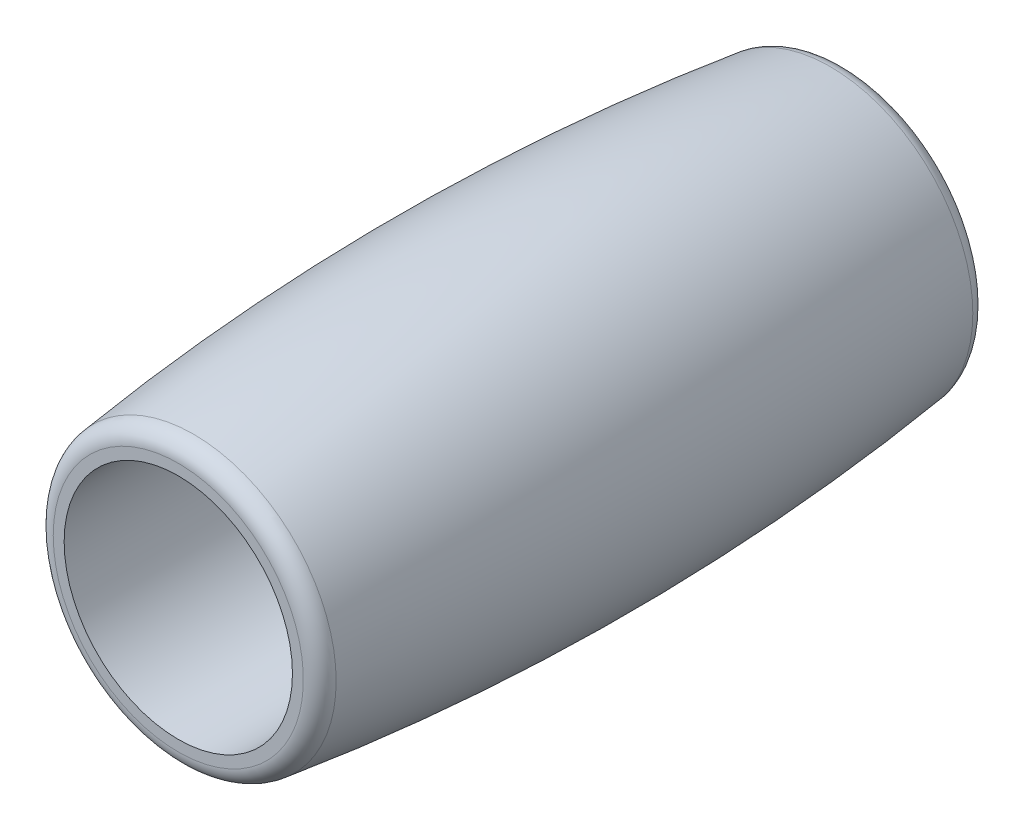
ISO-10303-21;
HEADER;
FILE_DESCRIPTION(('STEP AP214'),'2;1');
FILE_NAME('part.step','',(''),(''),'','','');
FILE_SCHEMA(('AUTOMOTIVE_DESIGN { 1 0 10303 214 1 1 1 1 }'));
ENDSEC;
DATA;
#1=APPLICATION_CONTEXT('core data for automotive mechanical design processes');
#2=APPLICATION_PROTOCOL_DEFINITION('international standard','automotive_design',2000,#1);
#3=PRODUCT_CONTEXT('',#1,'mechanical');
#4=PRODUCT('Part','Part','',(#3));
#5=PRODUCT_RELATED_PRODUCT_CATEGORY('part','',(#4));
#6=PRODUCT_DEFINITION_FORMATION('','',#4);
#7=PRODUCT_DEFINITION_CONTEXT('part definition',#1,'design');
#8=PRODUCT_DEFINITION('design','',#6,#7);
#9=PRODUCT_DEFINITION_SHAPE('','',#8);
#10=(LENGTH_UNIT() NAMED_UNIT(*) SI_UNIT(.MILLI.,.METRE.));
#11=(NAMED_UNIT(*) PLANE_ANGLE_UNIT() SI_UNIT($,.RADIAN.));
#12=(NAMED_UNIT(*) SI_UNIT($,.STERADIAN.) SOLID_ANGLE_UNIT());
#13=UNCERTAINTY_MEASURE_WITH_UNIT(LENGTH_MEASURE(1.E-05),#10,'distance_accuracy_value','');
#14=(GEOMETRIC_REPRESENTATION_CONTEXT(3) GLOBAL_UNCERTAINTY_ASSIGNED_CONTEXT((#13)) GLOBAL_UNIT_ASSIGNED_CONTEXT((#10,
#11,#12)) REPRESENTATION_CONTEXT('',''));
#15=CARTESIAN_POINT('',(0.,0.,0.));
#16=DIRECTION('',(0.,0.,1.));
#17=DIRECTION('',(1.,0.,0.));
#18=AXIS2_PLACEMENT_3D('',#15,#16,#17);
#19=CARTESIAN_POINT('',(0.,0.,-0.597114905425203));
#20=DIRECTION('',(0.,0.,-1.));
#21=DIRECTION('',(-1.,0.,0.));
#22=AXIS2_PLACEMENT_3D('',#19,#20,#21);
#23=DEGENERATE_TOROIDAL_SURFACE('',#22,135.775,145.025,.F.);
#24=CARTESIAN_POINT('',(0.,0.,-18.7220932078033));
#25=DIRECTION('',(0.,0.,1.));
#26=DIRECTION('',(1.,0.,0.));
#27=AXIS2_PLACEMENT_3D('',#24,#25,#26);
#28=CIRCLE('',#27,8.11292786936064);
#29=CARTESIAN_POINT('',(8.11292786936064,0.,-18.7220932078033));
#30=VERTEX_POINT('',#29);
#31=EDGE_CURVE('E10',#30,#30,#28,.T.);
#32=ORIENTED_EDGE('',*,*,#31,.T.);
#33=EDGE_LOOP('',(#32));
#34=FACE_BOUND('',#33,.T.);
#35=CARTESIAN_POINT('',(0.,0.,17.5278633969529));
#36=DIRECTION('',(0.,0.,-1.));
#37=DIRECTION('',(-1.,0.,0.));
#38=AXIS2_PLACEMENT_3D('',#35,#36,#37);
#39=CIRCLE('',#38,8.11292786936064);
#40=CARTESIAN_POINT('',(-8.11292786936064,0.,17.5278633969529));
#41=VERTEX_POINT('',#40);
#42=EDGE_CURVE('E55',#41,#41,#39,.T.);
#43=ORIENTED_EDGE('',*,*,#42,.T.);
#44=EDGE_LOOP('',(#43));
#45=FACE_BOUND('',#44,.T.);
#46=ADVANCED_FACE('F36',(#34,#45),#23,.F.);
#47=CARTESIAN_POINT('',(8.,0.,-19.5971149054252));
#48=DIRECTION('',(0.,0.,1.));
#49=DIRECTION('',(1.,0.,0.));
#50=AXIS2_PLACEMENT_3D('',#47,#48,#49);
#51=PLANE('',#50);
#52=CARTESIAN_POINT('',(0.,0.,-19.5971149054252));
#53=DIRECTION('',(0.,0.,1.));
#54=DIRECTION('',(1.,0.,0.));
#55=AXIS2_PLACEMENT_3D('',#52,#53,#54);
#56=CIRCLE('',#55,7.120768394309);
#57=CARTESIAN_POINT('',(7.120768394309,0.,-19.5971149054252));
#58=VERTEX_POINT('',#57);
#59=EDGE_CURVE('E44',#58,#58,#56,.F.);
#60=ORIENTED_EDGE('',*,*,#59,.T.);
#61=EDGE_LOOP('',(#60));
#62=FACE_BOUND('',#61,.T.);
#63=CARTESIAN_POINT('',(0.,0.,-19.5971149054252));
#64=DIRECTION('',(0.,0.,-1.));
#65=DIRECTION('',(-1.,0.,0.));
#66=AXIS2_PLACEMENT_3D('',#63,#64,#65);
#67=CIRCLE('',#66,6.5);
#68=CARTESIAN_POINT('',(-6.5,0.,-19.5971149054252));
#69=VERTEX_POINT('',#68);
#70=EDGE_CURVE('E61',#69,#69,#67,.T.);
#71=ORIENTED_EDGE('',*,*,#70,.F.);
#72=EDGE_LOOP('',(#71));
#73=FACE_BOUND('',#72,.T.);
#74=ADVANCED_FACE('F74',(#62,#73),#51,.F.);
#75=CARTESIAN_POINT('',(0.,0.,-17.5604191692568));
#76=DIRECTION('',(0.,0.,-1.));
#77=DIRECTION('',(-1.,0.,0.));
#78=AXIS2_PLACEMENT_3D('',#75,#76,#77);
#79=CYLINDRICAL_SURFACE('',#78,6.5);
#80=CARTESIAN_POINT('',(0.,0.,18.4028850945748));
#81=DIRECTION('',(0.,0.,-1.));
#82=DIRECTION('',(-1.,0.,0.));
#83=AXIS2_PLACEMENT_3D('',#80,#81,#82);
#84=CIRCLE('',#83,6.5);
#85=CARTESIAN_POINT('',(-6.5,0.,18.4028850945748));
#86=VERTEX_POINT('',#85);
#87=EDGE_CURVE('E65',#86,#86,#84,.T.);
#88=ORIENTED_EDGE('',*,*,#87,.F.);
#89=EDGE_LOOP('',(#88));
#90=FACE_BOUND('',#89,.T.);
#91=ORIENTED_EDGE('',*,*,#70,.T.);
#92=EDGE_LOOP('',(#91));
#93=FACE_BOUND('',#92,.T.);
#94=ADVANCED_FACE('F71',(#90,#93),#79,.F.);
#95=CARTESIAN_POINT('',(6.5,0.,18.4028850945748));
#96=DIRECTION('',(0.,0.,-1.));
#97=DIRECTION('',(-1.,0.,0.));
#98=AXIS2_PLACEMENT_3D('',#95,#96,#97);
#99=PLANE('',#98);
#100=CARTESIAN_POINT('',(0.,0.,18.4028850945748));
#101=DIRECTION('',(0.,0.,-1.));
#102=DIRECTION('',(-1.,0.,0.));
#103=AXIS2_PLACEMENT_3D('',#100,#101,#102);
#104=CIRCLE('',#103,7.120768394309);
#105=CARTESIAN_POINT('',(-7.120768394309,0.,18.4028850945748));
#106=VERTEX_POINT('',#105);
#107=EDGE_CURVE('E50',#106,#106,#104,.F.);
#108=ORIENTED_EDGE('',*,*,#107,.T.);
#109=EDGE_LOOP('',(#108));
#110=FACE_BOUND('',#109,.T.);
#111=ORIENTED_EDGE('',*,*,#87,.T.);
#112=EDGE_LOOP('',(#111));
#113=FACE_BOUND('',#112,.T.);
#114=ADVANCED_FACE('F69',(#110,#113),#99,.F.);
#115=CARTESIAN_POINT('',(0.,0.,17.4028850945748));
#116=DIRECTION('',(0.,0.,-1.));
#117=DIRECTION('',(-1.,0.,0.));
#118=AXIS2_PLACEMENT_3D('',#115,#116,#117);
#119=TOROIDAL_SURFACE('',#118,7.120768394309,1.);
#120=ORIENTED_EDGE('',*,*,#107,.F.);
#121=EDGE_LOOP('',(#120));
#122=FACE_BOUND('',#121,.T.);
#123=ORIENTED_EDGE('',*,*,#42,.F.);
#124=EDGE_LOOP('',(#123));
#125=FACE_BOUND('',#124,.T.);
#126=ADVANCED_FACE('F85',(#122,#125),#119,.T.);
#127=CARTESIAN_POINT('',(0.,0.,-18.5971149054252));
#128=DIRECTION('',(0.,0.,1.));
#129=DIRECTION('',(1.,0.,0.));
#130=AXIS2_PLACEMENT_3D('',#127,#128,#129);
#131=TOROIDAL_SURFACE('',#130,7.120768394309,1.);
#132=ORIENTED_EDGE('',*,*,#31,.F.);
#133=EDGE_LOOP('',(#132));
#134=FACE_BOUND('',#133,.T.);
#135=ORIENTED_EDGE('',*,*,#59,.F.);
#136=EDGE_LOOP('',(#135));
#137=FACE_BOUND('',#136,.T.);
#138=ADVANCED_FACE('F38',(#134,#137),#131,.T.);
#139=CLOSED_SHELL('',(#46,#74,#94,#114,#126,#138));
#140=MANIFOLD_SOLID_BREP('B2',#139);
#141=ADVANCED_BREP_SHAPE_REPRESENTATION('',(#18,#140),#14);
#142=SHAPE_DEFINITION_REPRESENTATION(#9,#141);
ENDSEC;
END-ISO-10303-21;
